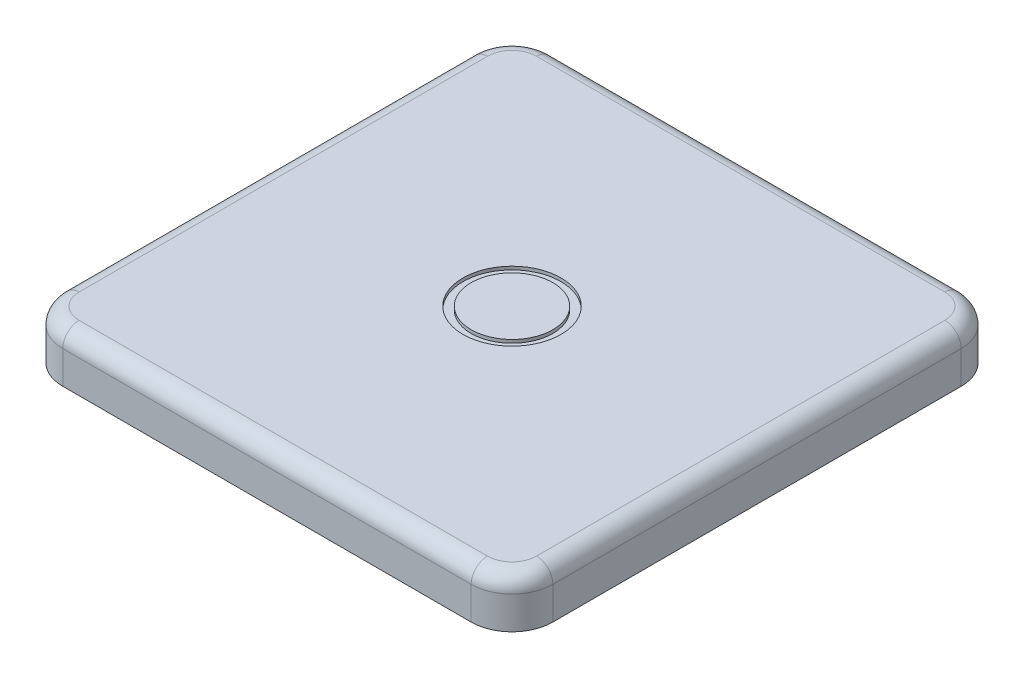
ISO-10303-21;
HEADER;
FILE_DESCRIPTION(('STEP AP214'),'2;1');
FILE_NAME('part.step','',(''),(''),'','','');
FILE_SCHEMA(('AUTOMOTIVE_DESIGN { 1 0 10303 214 1 1 1 1 }'));
ENDSEC;
DATA;
#1=APPLICATION_CONTEXT('core data for automotive mechanical design processes');
#2=APPLICATION_PROTOCOL_DEFINITION('international standard','automotive_design',2000,#1);
#3=PRODUCT_CONTEXT('',#1,'mechanical');
#4=PRODUCT('Part','Part','',(#3));
#5=PRODUCT_RELATED_PRODUCT_CATEGORY('part','',(#4));
#6=PRODUCT_DEFINITION_FORMATION('','',#4);
#7=PRODUCT_DEFINITION_CONTEXT('part definition',#1,'design');
#8=PRODUCT_DEFINITION('design','',#6,#7);
#9=PRODUCT_DEFINITION_SHAPE('','',#8);
#10=(LENGTH_UNIT() NAMED_UNIT(*) SI_UNIT(.MILLI.,.METRE.));
#11=(NAMED_UNIT(*) PLANE_ANGLE_UNIT() SI_UNIT($,.RADIAN.));
#12=(NAMED_UNIT(*) SI_UNIT($,.STERADIAN.) SOLID_ANGLE_UNIT());
#13=UNCERTAINTY_MEASURE_WITH_UNIT(LENGTH_MEASURE(1.E-05),#10,'distance_accuracy_value','');
#14=(GEOMETRIC_REPRESENTATION_CONTEXT(3) GLOBAL_UNCERTAINTY_ASSIGNED_CONTEXT((#13)) GLOBAL_UNIT_ASSIGNED_CONTEXT((#10,
#11,#12)) REPRESENTATION_CONTEXT('',''));
#15=CARTESIAN_POINT('',(0.,0.,0.));
#16=DIRECTION('',(0.,0.,1.));
#17=DIRECTION('',(1.,0.,0.));
#18=AXIS2_PLACEMENT_3D('',#15,#16,#17);
#19=CARTESIAN_POINT('',(15.,3.,-15.));
#20=DIRECTION('',(-1.,0.,0.));
#21=DIRECTION('',(0.,0.,1.));
#22=AXIS2_PLACEMENT_3D('',#19,#20,#21);
#23=PLANE('',#22);
#24=DIRECTION('',(0.,-1.,0.));
#25=VECTOR('',#24,1.);
#26=CARTESIAN_POINT('',(15.,3.,-12.5));
#27=LINE('',#26,#25);
#28=CARTESIAN_POINT('',(15.,0.,-12.5));
#29=VERTEX_POINT('',#28);
#30=CARTESIAN_POINT('',(15.,2.,-12.5));
#31=VERTEX_POINT('',#30);
#32=EDGE_CURVE('E208',#29,#31,#27,.F.);
#33=ORIENTED_EDGE('',*,*,#32,.T.);
#34=DIRECTION('',(0.,0.,-1.));
#35=VECTOR('',#34,1.);
#36=CARTESIAN_POINT('',(15.,2.,12.5));
#37=LINE('',#36,#35);
#38=CARTESIAN_POINT('',(15.,2.,12.5));
#39=VERTEX_POINT('',#38);
#40=EDGE_CURVE('E248',#31,#39,#37,.F.);
#41=ORIENTED_EDGE('',*,*,#40,.T.);
#42=DIRECTION('',(0.,-1.,0.));
#43=VECTOR('',#42,1.);
#44=CARTESIAN_POINT('',(15.,3.,12.5));
#45=LINE('',#44,#43);
#46=CARTESIAN_POINT('',(15.,0.,12.5));
#47=VERTEX_POINT('',#46);
#48=EDGE_CURVE('E205',#39,#47,#45,.T.);
#49=ORIENTED_EDGE('',*,*,#48,.T.);
#50=DIRECTION('',(0.,0.,-1.));
#51=VECTOR('',#50,1.);
#52=CARTESIAN_POINT('',(15.,0.,-15.));
#53=LINE('',#52,#51);
#54=EDGE_CURVE('E189',#47,#29,#53,.T.);
#55=ORIENTED_EDGE('',*,*,#54,.T.);
#56=EDGE_LOOP('',(#33,#41,#49,#55));
#57=FACE_BOUND('',#56,.T.);
#58=ADVANCED_FACE('F41',(#57),#23,.F.);
#59=CARTESIAN_POINT('',(-15.,3.,-15.));
#60=DIRECTION('',(0.,0.,1.));
#61=DIRECTION('',(1.,0.,0.));
#62=AXIS2_PLACEMENT_3D('',#59,#60,#61);
#63=PLANE('',#62);
#64=DIRECTION('',(0.,-1.,0.));
#65=VECTOR('',#64,1.);
#66=CARTESIAN_POINT('',(-12.5,3.,-15.));
#67=LINE('',#66,#65);
#68=CARTESIAN_POINT('',(-12.5,0.,-15.));
#69=VERTEX_POINT('',#68);
#70=CARTESIAN_POINT('',(-12.5,2.,-15.));
#71=VERTEX_POINT('',#70);
#72=EDGE_CURVE('E168',#69,#71,#67,.F.);
#73=ORIENTED_EDGE('',*,*,#72,.T.);
#74=DIRECTION('',(-1.,0.,0.));
#75=VECTOR('',#74,1.);
#76=CARTESIAN_POINT('',(12.5,2.,-15.));
#77=LINE('',#76,#75);
#78=CARTESIAN_POINT('',(12.5,2.,-15.));
#79=VERTEX_POINT('',#78);
#80=EDGE_CURVE('E11',#71,#79,#77,.F.);
#81=ORIENTED_EDGE('',*,*,#80,.T.);
#82=DIRECTION('',(0.,-1.,0.));
#83=VECTOR('',#82,1.);
#84=CARTESIAN_POINT('',(12.5,3.,-15.));
#85=LINE('',#84,#83);
#86=CARTESIAN_POINT('',(12.5,0.,-15.));
#87=VERTEX_POINT('',#86);
#88=EDGE_CURVE('E173',#79,#87,#85,.T.);
#89=ORIENTED_EDGE('',*,*,#88,.T.);
#90=DIRECTION('',(-1.,0.,0.));
#91=VECTOR('',#90,1.);
#92=CARTESIAN_POINT('',(-15.,0.,-15.));
#93=LINE('',#92,#91);
#94=EDGE_CURVE('E182',#87,#69,#93,.T.);
#95=ORIENTED_EDGE('',*,*,#94,.T.);
#96=EDGE_LOOP('',(#73,#81,#89,#95));
#97=FACE_BOUND('',#96,.T.);
#98=ADVANCED_FACE('F381',(#97),#63,.F.);
#99=CARTESIAN_POINT('',(-15.,3.,-15.));
#100=DIRECTION('',(1.,0.,0.));
#101=DIRECTION('',(0.,0.,-1.));
#102=AXIS2_PLACEMENT_3D('',#99,#100,#101);
#103=PLANE('',#102);
#104=DIRECTION('',(0.,-1.,0.));
#105=VECTOR('',#104,1.);
#106=CARTESIAN_POINT('',(-15.,3.,12.5));
#107=LINE('',#106,#105);
#108=CARTESIAN_POINT('',(-15.,0.,12.5));
#109=VERTEX_POINT('',#108);
#110=CARTESIAN_POINT('',(-15.,2.,12.5));
#111=VERTEX_POINT('',#110);
#112=EDGE_CURVE('E164',#109,#111,#107,.F.);
#113=ORIENTED_EDGE('',*,*,#112,.T.);
#114=DIRECTION('',(0.,0.,1.));
#115=VECTOR('',#114,1.);
#116=CARTESIAN_POINT('',(-15.,2.,-12.5));
#117=LINE('',#116,#115);
#118=CARTESIAN_POINT('',(-15.,2.,-12.5));
#119=VERTEX_POINT('',#118);
#120=EDGE_CURVE('E71',#111,#119,#117,.F.);
#121=ORIENTED_EDGE('',*,*,#120,.T.);
#122=DIRECTION('',(0.,-1.,0.));
#123=VECTOR('',#122,1.);
#124=CARTESIAN_POINT('',(-15.,3.,-12.5));
#125=LINE('',#124,#123);
#126=CARTESIAN_POINT('',(-15.,0.,-12.5));
#127=VERTEX_POINT('',#126);
#128=EDGE_CURVE('E155',#119,#127,#125,.T.);
#129=ORIENTED_EDGE('',*,*,#128,.T.);
#130=DIRECTION('',(0.,0.,1.));
#131=VECTOR('',#130,1.);
#132=CARTESIAN_POINT('',(-15.,0.,-15.));
#133=LINE('',#132,#131);
#134=EDGE_CURVE('E159',#127,#109,#133,.T.);
#135=ORIENTED_EDGE('',*,*,#134,.T.);
#136=EDGE_LOOP('',(#113,#121,#129,#135));
#137=FACE_BOUND('',#136,.T.);
#138=ADVANCED_FACE('F157',(#137),#103,.F.);
#139=CARTESIAN_POINT('',(-15.,3.,15.));
#140=DIRECTION('',(0.,0.,-1.));
#141=DIRECTION('',(-1.,0.,0.));
#142=AXIS2_PLACEMENT_3D('',#139,#140,#141);
#143=PLANE('',#142);
#144=DIRECTION('',(0.,-1.,0.));
#145=VECTOR('',#144,1.);
#146=CARTESIAN_POINT('',(12.5,3.,15.));
#147=LINE('',#146,#145);
#148=CARTESIAN_POINT('',(12.5,0.,15.));
#149=VERTEX_POINT('',#148);
#150=CARTESIAN_POINT('',(12.5,2.,15.));
#151=VERTEX_POINT('',#150);
#152=EDGE_CURVE('E212',#149,#151,#147,.F.);
#153=ORIENTED_EDGE('',*,*,#152,.T.);
#154=DIRECTION('',(1.,0.,0.));
#155=VECTOR('',#154,1.);
#156=CARTESIAN_POINT('',(-12.5,2.,15.));
#157=LINE('',#156,#155);
#158=CARTESIAN_POINT('',(-12.5,2.,15.));
#159=VERTEX_POINT('',#158);
#160=EDGE_CURVE('E254',#151,#159,#157,.F.);
#161=ORIENTED_EDGE('',*,*,#160,.T.);
#162=DIRECTION('',(0.,-1.,0.));
#163=VECTOR('',#162,1.);
#164=CARTESIAN_POINT('',(-12.5,3.,15.));
#165=LINE('',#164,#163);
#166=CARTESIAN_POINT('',(-12.5,0.,15.));
#167=VERTEX_POINT('',#166);
#168=EDGE_CURVE('E216',#159,#167,#165,.T.);
#169=ORIENTED_EDGE('',*,*,#168,.T.);
#170=DIRECTION('',(1.,0.,0.));
#171=VECTOR('',#170,1.);
#172=CARTESIAN_POINT('',(-15.,0.,15.));
#173=LINE('',#172,#171);
#174=EDGE_CURVE('E181',#167,#149,#173,.T.);
#175=ORIENTED_EDGE('',*,*,#174,.T.);
#176=EDGE_LOOP('',(#153,#161,#169,#175));
#177=FACE_BOUND('',#176,.T.);
#178=ADVANCED_FACE('F338',(#177),#143,.F.);
#179=CARTESIAN_POINT('',(0.,3.,0.));
#180=DIRECTION('',(0.,1.,0.));
#181=DIRECTION('',(0.,0.,1.));
#182=AXIS2_PLACEMENT_3D('',#179,#180,#181);
#183=PLANE('',#182);
#184=CARTESIAN_POINT('',(0.,3.,0.));
#185=DIRECTION('',(0.,1.,0.));
#186=DIRECTION('',(0.,0.,1.));
#187=AXIS2_PLACEMENT_3D('',#184,#185,#186);
#188=CIRCLE('',#187,3.);
#189=CARTESIAN_POINT('',(0.,3.,3.));
#190=VERTEX_POINT('',#189);
#191=EDGE_CURVE('E304',#190,#190,#188,.T.);
#192=ORIENTED_EDGE('',*,*,#191,.F.);
#193=EDGE_LOOP('',(#192));
#194=FACE_BOUND('',#193,.T.);
#195=DIRECTION('',(0.,0.,-1.));
#196=VECTOR('',#195,1.);
#197=CARTESIAN_POINT('',(14.,3.,-12.5));
#198=LINE('',#197,#196);
#199=CARTESIAN_POINT('',(14.,3.,12.5));
#200=VERTEX_POINT('',#199);
#201=CARTESIAN_POINT('',(14.,3.,-12.5));
#202=VERTEX_POINT('',#201);
#203=EDGE_CURVE('E237',#200,#202,#198,.T.);
#204=ORIENTED_EDGE('',*,*,#203,.T.);
#205=CARTESIAN_POINT('',(12.5,3.,-12.5));
#206=DIRECTION('',(0.,1.,0.));
#207=DIRECTION('',(0.,0.,1.));
#208=AXIS2_PLACEMENT_3D('',#205,#206,#207);
#209=CIRCLE('',#208,1.5);
#210=CARTESIAN_POINT('',(12.5,3.,-14.));
#211=VERTEX_POINT('',#210);
#212=EDGE_CURVE('E240',#202,#211,#209,.T.);
#213=ORIENTED_EDGE('',*,*,#212,.T.);
#214=DIRECTION('',(-1.,0.,0.));
#215=VECTOR('',#214,1.);
#216=CARTESIAN_POINT('',(-12.5,3.,-14.));
#217=LINE('',#216,#215);
#218=CARTESIAN_POINT('',(-12.5,3.,-14.));
#219=VERTEX_POINT('',#218);
#220=EDGE_CURVE('E219',#211,#219,#217,.T.);
#221=ORIENTED_EDGE('',*,*,#220,.T.);
#222=CARTESIAN_POINT('',(-12.5,3.,-12.5));
#223=DIRECTION('',(0.,1.,0.));
#224=DIRECTION('',(0.,0.,1.));
#225=AXIS2_PLACEMENT_3D('',#222,#223,#224);
#226=CIRCLE('',#225,1.5);
#227=CARTESIAN_POINT('',(-14.,3.,-12.5));
#228=VERTEX_POINT('',#227);
#229=EDGE_CURVE('E222',#219,#228,#226,.T.);
#230=ORIENTED_EDGE('',*,*,#229,.T.);
#231=DIRECTION('',(0.,0.,1.));
#232=VECTOR('',#231,1.);
#233=CARTESIAN_POINT('',(-14.,3.,12.5));
#234=LINE('',#233,#232);
#235=CARTESIAN_POINT('',(-14.,3.,12.5));
#236=VERTEX_POINT('',#235);
#237=EDGE_CURVE('E225',#228,#236,#234,.T.);
#238=ORIENTED_EDGE('',*,*,#237,.T.);
#239=CARTESIAN_POINT('',(-12.5,3.,12.5));
#240=DIRECTION('',(0.,1.,0.));
#241=DIRECTION('',(0.,0.,1.));
#242=AXIS2_PLACEMENT_3D('',#239,#240,#241);
#243=CIRCLE('',#242,1.5);
#244=CARTESIAN_POINT('',(-12.5,3.,14.));
#245=VERTEX_POINT('',#244);
#246=EDGE_CURVE('E228',#236,#245,#243,.T.);
#247=ORIENTED_EDGE('',*,*,#246,.T.);
#248=DIRECTION('',(1.,0.,0.));
#249=VECTOR('',#248,1.);
#250=CARTESIAN_POINT('',(12.5,3.,14.));
#251=LINE('',#250,#249);
#252=CARTESIAN_POINT('',(12.5,3.,14.));
#253=VERTEX_POINT('',#252);
#254=EDGE_CURVE('E231',#245,#253,#251,.T.);
#255=ORIENTED_EDGE('',*,*,#254,.T.);
#256=CARTESIAN_POINT('',(12.5,3.,12.5));
#257=DIRECTION('',(0.,1.,0.));
#258=DIRECTION('',(0.,0.,1.));
#259=AXIS2_PLACEMENT_3D('',#256,#257,#258);
#260=CIRCLE('',#259,1.5);
#261=EDGE_CURVE('E234',#253,#200,#260,.T.);
#262=ORIENTED_EDGE('',*,*,#261,.T.);
#263=EDGE_LOOP('',(#204,#213,#221,#230,#238,#247,#255,#262));
#264=FACE_BOUND('',#263,.T.);
#265=ADVANCED_FACE('F335',(#194,#264),#183,.T.);
#266=CARTESIAN_POINT('',(0.,0.,0.));
#267=DIRECTION('',(0.,1.,0.));
#268=DIRECTION('',(0.,0.,1.));
#269=AXIS2_PLACEMENT_3D('',#266,#267,#268);
#270=PLANE('',#269);
#271=ORIENTED_EDGE('',*,*,#134,.F.);
#272=CARTESIAN_POINT('',(-12.5,0.,-12.5));
#273=DIRECTION('',(0.,1.,0.));
#274=DIRECTION('',(0.,0.,1.));
#275=AXIS2_PLACEMENT_3D('',#272,#273,#274);
#276=CIRCLE('',#275,2.5);
#277=EDGE_CURVE('E166',#127,#69,#276,.F.);
#278=ORIENTED_EDGE('',*,*,#277,.T.);
#279=ORIENTED_EDGE('',*,*,#94,.F.);
#280=CARTESIAN_POINT('',(12.5,0.,-12.5));
#281=DIRECTION('',(0.,1.,0.));
#282=DIRECTION('',(0.,0.,1.));
#283=AXIS2_PLACEMENT_3D('',#280,#281,#282);
#284=CIRCLE('',#283,2.5);
#285=EDGE_CURVE('E174',#87,#29,#284,.F.);
#286=ORIENTED_EDGE('',*,*,#285,.T.);
#287=ORIENTED_EDGE('',*,*,#54,.F.);
#288=CARTESIAN_POINT('',(12.5,0.,12.5));
#289=DIRECTION('',(0.,1.,0.));
#290=DIRECTION('',(0.,0.,1.));
#291=AXIS2_PLACEMENT_3D('',#288,#289,#290);
#292=CIRCLE('',#291,2.5);
#293=EDGE_CURVE('E163',#47,#149,#292,.F.);
#294=ORIENTED_EDGE('',*,*,#293,.T.);
#295=ORIENTED_EDGE('',*,*,#174,.F.);
#296=CARTESIAN_POINT('',(-12.5,0.,12.5));
#297=DIRECTION('',(0.,1.,0.));
#298=DIRECTION('',(0.,0.,1.));
#299=AXIS2_PLACEMENT_3D('',#296,#297,#298);
#300=CIRCLE('',#299,2.5);
#301=EDGE_CURVE('E179',#167,#109,#300,.F.);
#302=ORIENTED_EDGE('',*,*,#301,.T.);
#303=EDGE_LOOP('',(#271,#278,#279,#286,#287,#294,#295,#302));
#304=FACE_BOUND('',#303,.T.);
#305=ADVANCED_FACE('F176',(#304),#270,.F.);
#306=CARTESIAN_POINT('',(-12.5,3.,-12.5));
#307=DIRECTION('',(0.,-1.,0.));
#308=DIRECTION('',(0.,0.,-1.));
#309=AXIS2_PLACEMENT_3D('',#306,#307,#308);
#310=CYLINDRICAL_SURFACE('',#309,2.5);
#311=ORIENTED_EDGE('',*,*,#128,.F.);
#312=CARTESIAN_POINT('',(-12.5,2.,-12.5));
#313=DIRECTION('',(0.,1.,0.));
#314=DIRECTION('',(0.,0.,1.));
#315=AXIS2_PLACEMENT_3D('',#312,#313,#314);
#316=CIRCLE('',#315,2.5);
#317=EDGE_CURVE('E51',#119,#71,#316,.F.);
#318=ORIENTED_EDGE('',*,*,#317,.T.);
#319=ORIENTED_EDGE('',*,*,#72,.F.);
#320=ORIENTED_EDGE('',*,*,#277,.F.);
#321=EDGE_LOOP('',(#311,#318,#319,#320));
#322=FACE_BOUND('',#321,.T.);
#323=ADVANCED_FACE('F167',(#322),#310,.T.);
#324=CARTESIAN_POINT('',(12.5,3.,-12.5));
#325=DIRECTION('',(0.,-1.,0.));
#326=DIRECTION('',(0.,0.,-1.));
#327=AXIS2_PLACEMENT_3D('',#324,#325,#326);
#328=CYLINDRICAL_SURFACE('',#327,2.5);
#329=ORIENTED_EDGE('',*,*,#88,.F.);
#330=CARTESIAN_POINT('',(12.5,2.,-12.5));
#331=DIRECTION('',(0.,1.,0.));
#332=DIRECTION('',(0.,0.,1.));
#333=AXIS2_PLACEMENT_3D('',#330,#331,#332);
#334=CIRCLE('',#333,2.5);
#335=EDGE_CURVE('E244',#79,#31,#334,.F.);
#336=ORIENTED_EDGE('',*,*,#335,.T.);
#337=ORIENTED_EDGE('',*,*,#32,.F.);
#338=ORIENTED_EDGE('',*,*,#285,.F.);
#339=EDGE_LOOP('',(#329,#336,#337,#338));
#340=FACE_BOUND('',#339,.T.);
#341=ADVANCED_FACE('F379',(#340),#328,.T.);
#342=CARTESIAN_POINT('',(-12.5,3.,12.5));
#343=DIRECTION('',(0.,-1.,0.));
#344=DIRECTION('',(0.,0.,-1.));
#345=AXIS2_PLACEMENT_3D('',#342,#343,#344);
#346=CYLINDRICAL_SURFACE('',#345,2.5);
#347=ORIENTED_EDGE('',*,*,#168,.F.);
#348=CARTESIAN_POINT('',(-12.5,2.,12.5));
#349=DIRECTION('',(0.,1.,0.));
#350=DIRECTION('',(0.,0.,1.));
#351=AXIS2_PLACEMENT_3D('',#348,#349,#350);
#352=CIRCLE('',#351,2.5);
#353=EDGE_CURVE('E257',#159,#111,#352,.F.);
#354=ORIENTED_EDGE('',*,*,#353,.T.);
#355=ORIENTED_EDGE('',*,*,#112,.F.);
#356=ORIENTED_EDGE('',*,*,#301,.F.);
#357=EDGE_LOOP('',(#347,#354,#355,#356));
#358=FACE_BOUND('',#357,.T.);
#359=ADVANCED_FACE('F394',(#358),#346,.T.);
#360=CARTESIAN_POINT('',(12.5,3.,12.5));
#361=DIRECTION('',(0.,-1.,0.));
#362=DIRECTION('',(0.,0.,-1.));
#363=AXIS2_PLACEMENT_3D('',#360,#361,#362);
#364=CYLINDRICAL_SURFACE('',#363,2.5);
#365=ORIENTED_EDGE('',*,*,#48,.F.);
#366=CARTESIAN_POINT('',(12.5,2.,12.5));
#367=DIRECTION('',(0.,1.,0.));
#368=DIRECTION('',(0.,0.,1.));
#369=AXIS2_PLACEMENT_3D('',#366,#367,#368);
#370=CIRCLE('',#369,2.5);
#371=EDGE_CURVE('E251',#39,#151,#370,.F.);
#372=ORIENTED_EDGE('',*,*,#371,.T.);
#373=ORIENTED_EDGE('',*,*,#152,.F.);
#374=ORIENTED_EDGE('',*,*,#293,.F.);
#375=EDGE_LOOP('',(#365,#372,#373,#374));
#376=FACE_BOUND('',#375,.T.);
#377=ADVANCED_FACE('F372',(#376),#364,.T.);
#378=CARTESIAN_POINT('',(-12.5,2.,12.5));
#379=DIRECTION('',(0.,1.,0.));
#380=DIRECTION('',(0.,0.,1.));
#381=AXIS2_PLACEMENT_3D('',#378,#379,#380);
#382=TOROIDAL_SURFACE('',#381,1.5,1.);
#383=CARTESIAN_POINT('',(-14.,2.,12.5));
#384=DIRECTION('',(0.,0.,-1.));
#385=DIRECTION('',(-1.,0.,0.));
#386=AXIS2_PLACEMENT_3D('',#383,#384,#385);
#387=CIRCLE('',#386,1.);
#388=EDGE_CURVE('E285',#111,#236,#387,.T.);
#389=ORIENTED_EDGE('',*,*,#388,.F.);
#390=ORIENTED_EDGE('',*,*,#353,.F.);
#391=CARTESIAN_POINT('',(-12.5,2.,14.));
#392=DIRECTION('',(1.,0.,0.));
#393=DIRECTION('',(0.,0.,-1.));
#394=AXIS2_PLACEMENT_3D('',#391,#392,#393);
#395=CIRCLE('',#394,1.);
#396=EDGE_CURVE('E45',#245,#159,#395,.T.);
#397=ORIENTED_EDGE('',*,*,#396,.F.);
#398=ORIENTED_EDGE('',*,*,#246,.F.);
#399=EDGE_LOOP('',(#389,#390,#397,#398));
#400=FACE_BOUND('',#399,.T.);
#401=ADVANCED_FACE('F43',(#400),#382,.T.);
#402=CARTESIAN_POINT('',(0.,2.,14.));
#403=DIRECTION('',(-1.,0.,0.));
#404=DIRECTION('',(0.,0.,1.));
#405=AXIS2_PLACEMENT_3D('',#402,#403,#404);
#406=CYLINDRICAL_SURFACE('',#405,1.);
#407=ORIENTED_EDGE('',*,*,#396,.T.);
#408=ORIENTED_EDGE('',*,*,#160,.F.);
#409=CARTESIAN_POINT('',(12.5,2.,14.));
#410=DIRECTION('',(1.,0.,0.));
#411=DIRECTION('',(0.,0.,-1.));
#412=AXIS2_PLACEMENT_3D('',#409,#410,#411);
#413=CIRCLE('',#412,1.);
#414=EDGE_CURVE('E282',#253,#151,#413,.T.);
#415=ORIENTED_EDGE('',*,*,#414,.F.);
#416=ORIENTED_EDGE('',*,*,#254,.F.);
#417=EDGE_LOOP('',(#407,#408,#415,#416));
#418=FACE_BOUND('',#417,.T.);
#419=ADVANCED_FACE('F365',(#418),#406,.T.);
#420=CARTESIAN_POINT('',(-14.,2.,0.));
#421=DIRECTION('',(0.,0.,-1.));
#422=DIRECTION('',(-1.,0.,0.));
#423=AXIS2_PLACEMENT_3D('',#420,#421,#422);
#424=CYLINDRICAL_SURFACE('',#423,1.);
#425=ORIENTED_EDGE('',*,*,#388,.T.);
#426=ORIENTED_EDGE('',*,*,#237,.F.);
#427=CARTESIAN_POINT('',(-14.,2.,-12.5));
#428=DIRECTION('',(0.,0.,-1.));
#429=DIRECTION('',(-1.,0.,0.));
#430=AXIS2_PLACEMENT_3D('',#427,#428,#429);
#431=CIRCLE('',#430,1.);
#432=EDGE_CURVE('E278',#119,#228,#431,.T.);
#433=ORIENTED_EDGE('',*,*,#432,.F.);
#434=ORIENTED_EDGE('',*,*,#120,.F.);
#435=EDGE_LOOP('',(#425,#426,#433,#434));
#436=FACE_BOUND('',#435,.T.);
#437=ADVANCED_FACE('F360',(#436),#424,.T.);
#438=CARTESIAN_POINT('',(12.5,2.,12.5));
#439=DIRECTION('',(0.,1.,0.));
#440=DIRECTION('',(0.,0.,1.));
#441=AXIS2_PLACEMENT_3D('',#438,#439,#440);
#442=TOROIDAL_SURFACE('',#441,1.5,1.);
#443=ORIENTED_EDGE('',*,*,#414,.T.);
#444=ORIENTED_EDGE('',*,*,#371,.F.);
#445=CARTESIAN_POINT('',(14.,2.,12.5));
#446=DIRECTION('',(0.,0.,-1.));
#447=DIRECTION('',(-1.,0.,0.));
#448=AXIS2_PLACEMENT_3D('',#445,#446,#447);
#449=CIRCLE('',#448,1.);
#450=EDGE_CURVE('E274',#200,#39,#449,.T.);
#451=ORIENTED_EDGE('',*,*,#450,.F.);
#452=ORIENTED_EDGE('',*,*,#261,.F.);
#453=EDGE_LOOP('',(#443,#444,#451,#452));
#454=FACE_BOUND('',#453,.T.);
#455=ADVANCED_FACE('F368',(#454),#442,.T.);
#456=CARTESIAN_POINT('',(-12.5,2.,-12.5));
#457=DIRECTION('',(0.,1.,0.));
#458=DIRECTION('',(0.,0.,1.));
#459=AXIS2_PLACEMENT_3D('',#456,#457,#458);
#460=TOROIDAL_SURFACE('',#459,1.5,1.);
#461=ORIENTED_EDGE('',*,*,#432,.T.);
#462=ORIENTED_EDGE('',*,*,#229,.F.);
#463=CARTESIAN_POINT('',(-12.5,2.,-14.));
#464=DIRECTION('',(1.,0.,0.));
#465=DIRECTION('',(0.,0.,-1.));
#466=AXIS2_PLACEMENT_3D('',#463,#464,#465);
#467=CIRCLE('',#466,1.);
#468=EDGE_CURVE('E270',#71,#219,#467,.T.);
#469=ORIENTED_EDGE('',*,*,#468,.F.);
#470=ORIENTED_EDGE('',*,*,#317,.F.);
#471=EDGE_LOOP('',(#461,#462,#469,#470));
#472=FACE_BOUND('',#471,.T.);
#473=ADVANCED_FACE('F359',(#472),#460,.T.);
#474=CARTESIAN_POINT('',(14.,2.,0.));
#475=DIRECTION('',(0.,0.,1.));
#476=DIRECTION('',(1.,0.,0.));
#477=AXIS2_PLACEMENT_3D('',#474,#475,#476);
#478=CYLINDRICAL_SURFACE('',#477,1.);
#479=ORIENTED_EDGE('',*,*,#450,.T.);
#480=ORIENTED_EDGE('',*,*,#40,.F.);
#481=CARTESIAN_POINT('',(14.,2.,-12.5));
#482=DIRECTION('',(0.,0.,-1.));
#483=DIRECTION('',(-1.,0.,0.));
#484=AXIS2_PLACEMENT_3D('',#481,#482,#483);
#485=CIRCLE('',#484,1.);
#486=EDGE_CURVE('E266',#202,#31,#485,.T.);
#487=ORIENTED_EDGE('',*,*,#486,.F.);
#488=ORIENTED_EDGE('',*,*,#203,.F.);
#489=EDGE_LOOP('',(#479,#480,#487,#488));
#490=FACE_BOUND('',#489,.T.);
#491=ADVANCED_FACE('F347',(#490),#478,.T.);
#492=CARTESIAN_POINT('',(0.,2.,-14.));
#493=DIRECTION('',(1.,0.,0.));
#494=DIRECTION('',(0.,0.,-1.));
#495=AXIS2_PLACEMENT_3D('',#492,#493,#494);
#496=CYLINDRICAL_SURFACE('',#495,1.);
#497=ORIENTED_EDGE('',*,*,#468,.T.);
#498=ORIENTED_EDGE('',*,*,#220,.F.);
#499=CARTESIAN_POINT('',(12.5,2.,-14.));
#500=DIRECTION('',(1.,0.,0.));
#501=DIRECTION('',(0.,0.,-1.));
#502=AXIS2_PLACEMENT_3D('',#499,#500,#501);
#503=CIRCLE('',#502,1.);
#504=EDGE_CURVE('E263',#79,#211,#503,.T.);
#505=ORIENTED_EDGE('',*,*,#504,.F.);
#506=ORIENTED_EDGE('',*,*,#80,.F.);
#507=EDGE_LOOP('',(#497,#498,#505,#506));
#508=FACE_BOUND('',#507,.T.);
#509=ADVANCED_FACE('F355',(#508),#496,.T.);
#510=CARTESIAN_POINT('',(12.5,2.,-12.5));
#511=DIRECTION('',(0.,1.,0.));
#512=DIRECTION('',(0.,0.,1.));
#513=AXIS2_PLACEMENT_3D('',#510,#511,#512);
#514=TOROIDAL_SURFACE('',#513,1.5,1.);
#515=ORIENTED_EDGE('',*,*,#486,.T.);
#516=ORIENTED_EDGE('',*,*,#335,.F.);
#517=ORIENTED_EDGE('',*,*,#504,.T.);
#518=ORIENTED_EDGE('',*,*,#212,.F.);
#519=EDGE_LOOP('',(#515,#516,#517,#518));
#520=FACE_BOUND('',#519,.T.);
#521=ADVANCED_FACE('F350',(#520),#514,.T.);
#522=CARTESIAN_POINT('',(0.,2.8,0.));
#523=DIRECTION('',(0.,1.,0.));
#524=DIRECTION('',(0.,0.,1.));
#525=AXIS2_PLACEMENT_3D('',#522,#523,#524);
#526=CYLINDRICAL_SURFACE('',#525,2.5);
#527=CARTESIAN_POINT('',(0.,2.8,0.));
#528=DIRECTION('',(0.,1.,0.));
#529=DIRECTION('',(0.,0.,1.));
#530=AXIS2_PLACEMENT_3D('',#527,#528,#529);
#531=CIRCLE('',#530,2.5);
#532=CARTESIAN_POINT('',(0.,2.8,2.5));
#533=VERTEX_POINT('',#532);
#534=EDGE_CURVE('E307',#533,#533,#531,.T.);
#535=ORIENTED_EDGE('',*,*,#534,.T.);
#536=EDGE_LOOP('',(#535));
#537=FACE_BOUND('',#536,.T.);
#538=CARTESIAN_POINT('',(0.,3.,0.));
#539=DIRECTION('',(0.,1.,0.));
#540=DIRECTION('',(0.,0.,1.));
#541=AXIS2_PLACEMENT_3D('',#538,#539,#540);
#542=CIRCLE('',#541,2.5);
#543=CARTESIAN_POINT('',(0.,3.,2.5));
#544=VERTEX_POINT('',#543);
#545=EDGE_CURVE('E308',#544,#544,#542,.T.);
#546=ORIENTED_EDGE('',*,*,#545,.F.);
#547=EDGE_LOOP('',(#546));
#548=FACE_BOUND('',#547,.T.);
#549=ADVANCED_FACE('F319',(#537,#548),#526,.T.);
#550=CARTESIAN_POINT('',(0.,2.8,0.));
#551=DIRECTION('',(0.,1.,0.));
#552=DIRECTION('',(0.,0.,1.));
#553=AXIS2_PLACEMENT_3D('',#550,#551,#552);
#554=CYLINDRICAL_SURFACE('',#553,3.);
#555=CARTESIAN_POINT('',(0.,2.8,0.));
#556=DIRECTION('',(0.,1.,0.));
#557=DIRECTION('',(0.,0.,1.));
#558=AXIS2_PLACEMENT_3D('',#555,#556,#557);
#559=CIRCLE('',#558,3.);
#560=CARTESIAN_POINT('',(0.,2.8,3.));
#561=VERTEX_POINT('',#560);
#562=EDGE_CURVE('E267',#561,#561,#559,.T.);
#563=ORIENTED_EDGE('',*,*,#562,.F.);
#564=EDGE_LOOP('',(#563));
#565=FACE_BOUND('',#564,.T.);
#566=ORIENTED_EDGE('',*,*,#191,.T.);
#567=EDGE_LOOP('',(#566));
#568=FACE_BOUND('',#567,.T.);
#569=ADVANCED_FACE('F326',(#565,#568),#554,.F.);
#570=CARTESIAN_POINT('',(0.,2.8,0.));
#571=DIRECTION('',(0.,1.,0.));
#572=DIRECTION('',(0.,0.,1.));
#573=AXIS2_PLACEMENT_3D('',#570,#571,#572);
#574=PLANE('',#573);
#575=ORIENTED_EDGE('',*,*,#534,.F.);
#576=EDGE_LOOP('',(#575));
#577=FACE_BOUND('',#576,.T.);
#578=ORIENTED_EDGE('',*,*,#562,.T.);
#579=EDGE_LOOP('',(#578));
#580=FACE_BOUND('',#579,.T.);
#581=ADVANCED_FACE('F322',(#577,#580),#574,.T.);
#582=ORIENTED_EDGE('',*,*,#545,.T.);
#583=EDGE_LOOP('',(#582));
#584=FACE_BOUND('',#583,.T.);
#585=ADVANCED_FACE('F325',(#584),#183,.T.);
#586=CLOSED_SHELL('',(#58,#98,#138,#178,#265,#305,#323,#341,#359,#377,#401,#419,#437,#455,#473,
#491,#509,#521,#549,#569,#581,#585));
#587=MANIFOLD_SOLID_BREP('B2',#586);
#588=ADVANCED_BREP_SHAPE_REPRESENTATION('',(#18,#587),#14);
#589=SHAPE_DEFINITION_REPRESENTATION(#9,#588);
ENDSEC;
END-ISO-10303-21;
